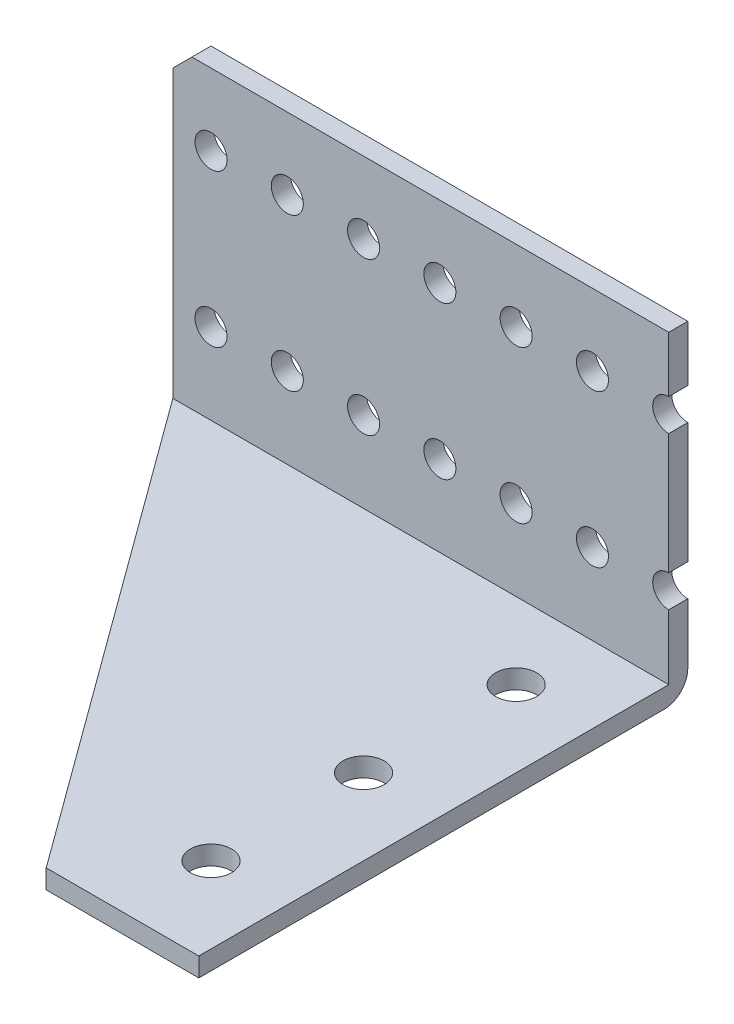
ISO-10303-21;
HEADER;
FILE_DESCRIPTION(('STEP AP214'),'2;1');
FILE_NAME('part.step','',(''),(''),'','','');
FILE_SCHEMA(('AUTOMOTIVE_DESIGN { 1 0 10303 214 1 1 1 1 }'));
ENDSEC;
DATA;
#1=APPLICATION_CONTEXT('core data for automotive mechanical design processes');
#2=APPLICATION_PROTOCOL_DEFINITION('international standard','automotive_design',2000,#1);
#3=PRODUCT_CONTEXT('',#1,'mechanical');
#4=PRODUCT('Part','Part','',(#3));
#5=PRODUCT_RELATED_PRODUCT_CATEGORY('part','',(#4));
#6=PRODUCT_DEFINITION_FORMATION('','',#4);
#7=PRODUCT_DEFINITION_CONTEXT('part definition',#1,'design');
#8=PRODUCT_DEFINITION('design','',#6,#7);
#9=PRODUCT_DEFINITION_SHAPE('','',#8);
#10=(LENGTH_UNIT() NAMED_UNIT(*) SI_UNIT(.MILLI.,.METRE.));
#11=(NAMED_UNIT(*) PLANE_ANGLE_UNIT() SI_UNIT($,.RADIAN.));
#12=(NAMED_UNIT(*) SI_UNIT($,.STERADIAN.) SOLID_ANGLE_UNIT());
#13=UNCERTAINTY_MEASURE_WITH_UNIT(LENGTH_MEASURE(1.E-05),#10,'distance_accuracy_value','');
#14=(GEOMETRIC_REPRESENTATION_CONTEXT(3) GLOBAL_UNCERTAINTY_ASSIGNED_CONTEXT((#13)) GLOBAL_UNIT_ASSIGNED_CONTEXT((#10,
#11,#12)) REPRESENTATION_CONTEXT('',''));
#15=CARTESIAN_POINT('',(0.,0.,0.));
#16=DIRECTION('',(0.,0.,1.));
#17=DIRECTION('',(1.,0.,0.));
#18=AXIS2_PLACEMENT_3D('',#15,#16,#17);
#19=CARTESIAN_POINT('',(41.275,-31.75,40.7035));
#20=DIRECTION('',(-1.,0.,0.));
#21=DIRECTION('',(0.,0.,1.));
#22=AXIS2_PLACEMENT_3D('',#19,#20,#21);
#23=PLANE('',#22);
#24=DIRECTION('',(0.,-1.,0.));
#25=VECTOR('',#24,1.);
#26=CARTESIAN_POINT('',(41.275,19.05,-37.5284999999999));
#27=LINE('',#26,#25);
#28=CARTESIAN_POINT('',(41.275,19.05,-37.5284999999999));
#29=VERTEX_POINT('',#28);
#30=CARTESIAN_POINT('',(41.275,9.779,-37.5284999999999));
#31=VERTEX_POINT('',#30);
#32=EDGE_CURVE('E158',#29,#31,#27,.T.);
#33=ORIENTED_EDGE('',*,*,#32,.T.);
#34=DIRECTION('',(0.,0.,-1.));
#35=VECTOR('',#34,1.);
#36=CARTESIAN_POINT('',(41.275,9.779,-40.7035));
#37=LINE('',#36,#35);
#38=CARTESIAN_POINT('',(41.275,9.779,-40.7035));
#39=VERTEX_POINT('',#38);
#40=EDGE_CURVE('E289',#31,#39,#37,.T.);
#41=ORIENTED_EDGE('',*,*,#40,.T.);
#42=DIRECTION('',(0.,-1.,0.));
#43=VECTOR('',#42,1.);
#44=CARTESIAN_POINT('',(41.275,-31.75,-40.7035));
#45=LINE('',#44,#43);
#46=CARTESIAN_POINT('',(41.275,19.05,-40.7035));
#47=VERTEX_POINT('',#46);
#48=EDGE_CURVE('E168',#47,#39,#45,.T.);
#49=ORIENTED_EDGE('',*,*,#48,.F.);
#50=DIRECTION('',(0.,0.,-1.));
#51=VECTOR('',#50,1.);
#52=CARTESIAN_POINT('',(41.275,19.05,-37.5284999999999));
#53=LINE('',#52,#51);
#54=EDGE_CURVE('E259',#29,#47,#53,.T.);
#55=ORIENTED_EDGE('',*,*,#54,.F.);
#56=EDGE_LOOP('',(#33,#41,#49,#55));
#57=FACE_BOUND('',#56,.T.);
#58=ADVANCED_FACE('F45',(#57),#23,.F.);
#59=CARTESIAN_POINT('',(41.275,-31.75,-40.7035));
#60=DIRECTION('',(0.,0.,1.));
#61=DIRECTION('',(1.,0.,0.));
#62=AXIS2_PLACEMENT_3D('',#59,#60,#61);
#63=PLANE('',#62);
#64=CARTESIAN_POINT('',(-22.225,7.11200000000002,-40.7035));
#65=DIRECTION('',(0.,0.,-1.));
#66=DIRECTION('',(-1.,0.,0.));
#67=AXIS2_PLACEMENT_3D('',#64,#65,#66);
#68=CIRCLE('',#67,2.66699999999999);
#69=CARTESIAN_POINT('',(-24.892,7.11200000000002,-40.7035));
#70=VERTEX_POINT('',#69);
#71=EDGE_CURVE('E338',#70,#70,#68,.T.);
#72=ORIENTED_EDGE('',*,*,#71,.F.);
#73=EDGE_LOOP('',(#72));
#74=FACE_BOUND('',#73,.T.);
#75=CARTESIAN_POINT('',(-9.52499999999998,7.11200000000002,-40.7035));
#76=DIRECTION('',(0.,0.,-1.));
#77=DIRECTION('',(-1.,0.,0.));
#78=AXIS2_PLACEMENT_3D('',#75,#76,#77);
#79=CIRCLE('',#78,2.66699999999998);
#80=CARTESIAN_POINT('',(-12.192,7.11200000000002,-40.7035));
#81=VERTEX_POINT('',#80);
#82=EDGE_CURVE('E210',#81,#81,#79,.T.);
#83=ORIENTED_EDGE('',*,*,#82,.F.);
#84=EDGE_LOOP('',(#83));
#85=FACE_BOUND('',#84,.T.);
#86=CARTESIAN_POINT('',(3.17500000000006,7.11200000000002,-40.7035));
#87=DIRECTION('',(0.,0.,-1.));
#88=DIRECTION('',(-1.,0.,0.));
#89=AXIS2_PLACEMENT_3D('',#86,#87,#88);
#90=CIRCLE('',#89,2.66699999999998);
#91=CARTESIAN_POINT('',(0.508000000000076,7.11200000000002,-40.7035));
#92=VERTEX_POINT('',#91);
#93=EDGE_CURVE('E209',#92,#92,#90,.T.);
#94=ORIENTED_EDGE('',*,*,#93,.F.);
#95=EDGE_LOOP('',(#94));
#96=FACE_BOUND('',#95,.T.);
#97=CARTESIAN_POINT('',(15.8750000000001,7.11200000000002,-40.7035));
#98=DIRECTION('',(0.,0.,-1.));
#99=DIRECTION('',(-1.,0.,0.));
#100=AXIS2_PLACEMENT_3D('',#97,#98,#99);
#101=CIRCLE('',#100,2.66699999999998);
#102=CARTESIAN_POINT('',(13.2080000000001,7.11200000000002,-40.7035));
#103=VERTEX_POINT('',#102);
#104=EDGE_CURVE('E205',#103,#103,#101,.T.);
#105=ORIENTED_EDGE('',*,*,#104,.F.);
#106=EDGE_LOOP('',(#105));
#107=FACE_BOUND('',#106,.T.);
#108=CARTESIAN_POINT('',(28.5750000000001,7.11200000000002,-40.7035));
#109=DIRECTION('',(0.,0.,-1.));
#110=DIRECTION('',(-1.,0.,0.));
#111=AXIS2_PLACEMENT_3D('',#108,#109,#110);
#112=CIRCLE('',#111,2.66699999999998);
#113=CARTESIAN_POINT('',(25.9080000000001,7.11200000000002,-40.7035));
#114=VERTEX_POINT('',#113);
#115=EDGE_CURVE('E201',#114,#114,#112,.T.);
#116=ORIENTED_EDGE('',*,*,#115,.F.);
#117=EDGE_LOOP('',(#116));
#118=FACE_BOUND('',#117,.T.);
#119=CARTESIAN_POINT('',(-22.225,-18.2879999999999,-40.7035));
#120=DIRECTION('',(0.,0.,-1.));
#121=DIRECTION('',(-1.,0.,0.));
#122=AXIS2_PLACEMENT_3D('',#119,#120,#121);
#123=CIRCLE('',#122,2.66699999999999);
#124=CARTESIAN_POINT('',(-24.892,-18.2879999999999,-40.7035));
#125=VERTEX_POINT('',#124);
#126=EDGE_CURVE('E200',#125,#125,#123,.T.);
#127=ORIENTED_EDGE('',*,*,#126,.F.);
#128=EDGE_LOOP('',(#127));
#129=FACE_BOUND('',#128,.T.);
#130=CARTESIAN_POINT('',(-9.52499999999998,-18.2879999999999,-40.7035));
#131=DIRECTION('',(0.,0.,-1.));
#132=DIRECTION('',(-1.,0.,0.));
#133=AXIS2_PLACEMENT_3D('',#130,#131,#132);
#134=CIRCLE('',#133,2.66699999999998);
#135=CARTESIAN_POINT('',(-12.192,-18.2879999999999,-40.7035));
#136=VERTEX_POINT('',#135);
#137=EDGE_CURVE('E196',#136,#136,#134,.T.);
#138=ORIENTED_EDGE('',*,*,#137,.F.);
#139=EDGE_LOOP('',(#138));
#140=FACE_BOUND('',#139,.T.);
#141=CARTESIAN_POINT('',(3.17500000000006,-18.2879999999999,-40.7035));
#142=DIRECTION('',(0.,0.,-1.));
#143=DIRECTION('',(-1.,0.,0.));
#144=AXIS2_PLACEMENT_3D('',#141,#142,#143);
#145=CIRCLE('',#144,2.66699999999998);
#146=CARTESIAN_POINT('',(0.508000000000076,-18.2879999999999,-40.7035));
#147=VERTEX_POINT('',#146);
#148=EDGE_CURVE('E192',#147,#147,#145,.T.);
#149=ORIENTED_EDGE('',*,*,#148,.F.);
#150=EDGE_LOOP('',(#149));
#151=FACE_BOUND('',#150,.T.);
#152=CARTESIAN_POINT('',(15.8750000000001,-18.2879999999999,-40.7035));
#153=DIRECTION('',(0.,0.,-1.));
#154=DIRECTION('',(-1.,0.,0.));
#155=AXIS2_PLACEMENT_3D('',#152,#153,#154);
#156=CIRCLE('',#155,2.66699999999998);
#157=CARTESIAN_POINT('',(13.2080000000001,-18.2879999999999,-40.7035));
#158=VERTEX_POINT('',#157);
#159=EDGE_CURVE('E188',#158,#158,#156,.T.);
#160=ORIENTED_EDGE('',*,*,#159,.F.);
#161=EDGE_LOOP('',(#160));
#162=FACE_BOUND('',#161,.T.);
#163=CARTESIAN_POINT('',(28.5750000000001,-18.2879999999999,-40.7035));
#164=DIRECTION('',(0.,0.,-1.));
#165=DIRECTION('',(-1.,0.,0.));
#166=AXIS2_PLACEMENT_3D('',#163,#164,#165);
#167=CIRCLE('',#166,2.66699999999998);
#168=CARTESIAN_POINT('',(25.9080000000001,-18.2879999999999,-40.7035));
#169=VERTEX_POINT('',#168);
#170=EDGE_CURVE('E187',#169,#169,#167,.T.);
#171=ORIENTED_EDGE('',*,*,#170,.F.);
#172=EDGE_LOOP('',(#171));
#173=FACE_BOUND('',#172,.T.);
#174=CARTESIAN_POINT('',(-34.925,7.11200000000002,-40.7035));
#175=DIRECTION('',(0.,0.,-1.));
#176=DIRECTION('',(-1.,0.,0.));
#177=AXIS2_PLACEMENT_3D('',#174,#175,#176);
#178=CIRCLE('',#177,2.66699999999998);
#179=CARTESIAN_POINT('',(-37.592,7.11200000000002,-40.7035));
#180=VERTEX_POINT('',#179);
#181=EDGE_CURVE('E305',#180,#180,#178,.T.);
#182=ORIENTED_EDGE('',*,*,#181,.F.);
#183=EDGE_LOOP('',(#182));
#184=FACE_BOUND('',#183,.T.);
#185=CARTESIAN_POINT('',(-34.925,-18.2879999999999,-40.7035));
#186=DIRECTION('',(0.,0.,-1.));
#187=DIRECTION('',(-1.,0.,0.));
#188=AXIS2_PLACEMENT_3D('',#185,#186,#187);
#189=CIRCLE('',#188,2.66699999999998);
#190=CARTESIAN_POINT('',(-37.592,-18.2879999999999,-40.7035));
#191=VERTEX_POINT('',#190);
#192=EDGE_CURVE('E299',#191,#191,#189,.T.);
#193=ORIENTED_EDGE('',*,*,#192,.F.);
#194=EDGE_LOOP('',(#193));
#195=FACE_BOUND('',#194,.T.);
#196=CARTESIAN_POINT('',(41.275,-20.9549999999999,-40.7035));
#197=VERTEX_POINT('',#196);
#198=CARTESIAN_POINT('',(41.275,-30.988,-40.7035));
#199=VERTEX_POINT('',#198);
#200=EDGE_CURVE('E167',#197,#199,#45,.T.);
#201=ORIENTED_EDGE('',*,*,#200,.T.);
#202=DIRECTION('',(-1.,0.,0.));
#203=VECTOR('',#202,1.);
#204=CARTESIAN_POINT('',(41.275,-30.988,-40.7035));
#205=LINE('',#204,#203);
#206=CARTESIAN_POINT('',(-41.275,-30.988,-40.7035));
#207=VERTEX_POINT('',#206);
#208=EDGE_CURVE('E219',#199,#207,#205,.T.);
#209=ORIENTED_EDGE('',*,*,#208,.T.);
#210=DIRECTION('',(0.,-1.,0.));
#211=VECTOR('',#210,1.);
#212=CARTESIAN_POINT('',(-41.275,-31.75,-40.7035));
#213=LINE('',#212,#211);
#214=CARTESIAN_POINT('',(-41.275,15.875,-40.7035));
#215=VERTEX_POINT('',#214);
#216=EDGE_CURVE('E164',#215,#207,#213,.T.);
#217=ORIENTED_EDGE('',*,*,#216,.F.);
#218=DIRECTION('',(-0.707106781186544,-0.707106781186551,0.));
#219=VECTOR('',#218,1.);
#220=CARTESIAN_POINT('',(-38.1,19.05,-40.7035));
#221=LINE('',#220,#219);
#222=CARTESIAN_POINT('',(-38.1,19.05,-40.7035));
#223=VERTEX_POINT('',#222);
#224=EDGE_CURVE('E217',#215,#223,#221,.F.);
#225=ORIENTED_EDGE('',*,*,#224,.T.);
#226=DIRECTION('',(-1.,0.,0.));
#227=VECTOR('',#226,1.);
#228=CARTESIAN_POINT('',(-41.275,19.05,-40.7035));
#229=LINE('',#228,#227);
#230=EDGE_CURVE('E254',#47,#223,#229,.T.);
#231=ORIENTED_EDGE('',*,*,#230,.F.);
#232=ORIENTED_EDGE('',*,*,#48,.T.);
#233=CARTESIAN_POINT('',(41.275,7.11200000000002,-40.7035));
#234=DIRECTION('',(0.,0.,-1.));
#235=DIRECTION('',(-1.,0.,0.));
#236=AXIS2_PLACEMENT_3D('',#233,#234,#235);
#237=CIRCLE('',#236,2.66699999999998);
#238=CARTESIAN_POINT('',(41.275,4.44500000000004,-40.7035));
#239=VERTEX_POINT('',#238);
#240=EDGE_CURVE('E294',#239,#39,#237,.T.);
#241=ORIENTED_EDGE('',*,*,#240,.F.);
#242=CARTESIAN_POINT('',(41.275,-15.621,-40.7035));
#243=VERTEX_POINT('',#242);
#244=EDGE_CURVE('E172',#239,#243,#45,.T.);
#245=ORIENTED_EDGE('',*,*,#244,.T.);
#246=CARTESIAN_POINT('',(41.275,-18.2879999999999,-40.7035));
#247=DIRECTION('',(0.,0.,-1.));
#248=DIRECTION('',(-1.,0.,0.));
#249=AXIS2_PLACEMENT_3D('',#246,#247,#248);
#250=CIRCLE('',#249,2.66699999999998);
#251=EDGE_CURVE('E237',#197,#243,#250,.T.);
#252=ORIENTED_EDGE('',*,*,#251,.F.);
#253=EDGE_LOOP('',(#201,#209,#217,#225,#231,#232,#241,#245,#252));
#254=FACE_BOUND('',#253,.T.);
#255=ADVANCED_FACE('F234',(#74,#85,#96,#107,#118,#129,#140,#151,#162,#173,#184,#195,#254),#63,.F.);
#256=ORIENTED_EDGE('',*,*,#244,.F.);
#257=DIRECTION('',(0.,0.,-1.));
#258=VECTOR('',#257,1.);
#259=CARTESIAN_POINT('',(41.275,4.44500000000004,-40.7035));
#260=LINE('',#259,#258);
#261=CARTESIAN_POINT('',(41.275,4.44500000000004,-37.5284999999999));
#262=VERTEX_POINT('',#261);
#263=EDGE_CURVE('E286',#239,#262,#260,.F.);
#264=ORIENTED_EDGE('',*,*,#263,.T.);
#265=CARTESIAN_POINT('',(41.275,-15.621,-37.5284999999999));
#266=VERTEX_POINT('',#265);
#267=EDGE_CURVE('E271',#262,#266,#27,.T.);
#268=ORIENTED_EDGE('',*,*,#267,.T.);
#269=DIRECTION('',(0.,0.,-1.));
#270=VECTOR('',#269,1.);
#271=CARTESIAN_POINT('',(41.275,-15.621,-40.7035));
#272=LINE('',#271,#270);
#273=EDGE_CURVE('E177',#266,#243,#272,.T.);
#274=ORIENTED_EDGE('',*,*,#273,.T.);
#275=EDGE_LOOP('',(#256,#264,#268,#274));
#276=FACE_BOUND('',#275,.T.);
#277=ADVANCED_FACE('F285',(#276),#23,.F.);
#278=CARTESIAN_POINT('',(-41.275,-31.75,40.7035));
#279=DIRECTION('',(0.,0.,-1.));
#280=DIRECTION('',(-1.,0.,0.));
#281=AXIS2_PLACEMENT_3D('',#278,#279,#280);
#282=PLANE('',#281);
#283=DIRECTION('',(1.,0.,0.));
#284=VECTOR('',#283,1.);
#285=CARTESIAN_POINT('',(-41.275,-31.75,40.7035));
#286=LINE('',#285,#284);
#287=CARTESIAN_POINT('',(15.875,-31.75,40.7035));
#288=VERTEX_POINT('',#287);
#289=CARTESIAN_POINT('',(41.275,-31.75,40.7035));
#290=VERTEX_POINT('',#289);
#291=EDGE_CURVE('E148',#288,#290,#286,.T.);
#292=ORIENTED_EDGE('',*,*,#291,.F.);
#293=DIRECTION('',(0.,-1.,0.));
#294=VECTOR('',#293,1.);
#295=CARTESIAN_POINT('',(15.875,19.05,40.7035));
#296=LINE('',#295,#294);
#297=CARTESIAN_POINT('',(15.875,-34.925,40.7035));
#298=VERTEX_POINT('',#297);
#299=EDGE_CURVE('E138',#288,#298,#296,.T.);
#300=ORIENTED_EDGE('',*,*,#299,.T.);
#301=DIRECTION('',(1.,0.,0.));
#302=VECTOR('',#301,1.);
#303=CARTESIAN_POINT('',(-41.275,-34.925,40.7035));
#304=LINE('',#303,#302);
#305=CARTESIAN_POINT('',(41.275,-34.925,40.7035));
#306=VERTEX_POINT('',#305);
#307=EDGE_CURVE('E147',#298,#306,#304,.T.);
#308=ORIENTED_EDGE('',*,*,#307,.T.);
#309=DIRECTION('',(0.,-1.,0.));
#310=VECTOR('',#309,1.);
#311=CARTESIAN_POINT('',(41.275,-31.75,40.7035));
#312=LINE('',#311,#310);
#313=EDGE_CURVE('E171',#290,#306,#312,.T.);
#314=ORIENTED_EDGE('',*,*,#313,.F.);
#315=EDGE_LOOP('',(#292,#300,#308,#314));
#316=FACE_BOUND('',#315,.T.);
#317=ADVANCED_FACE('F145',(#316),#282,.F.);
#318=DIRECTION('',(0.,0.,-1.));
#319=VECTOR('',#318,1.);
#320=CARTESIAN_POINT('',(41.275,-34.925,40.7035));
#321=LINE('',#320,#319);
#322=CARTESIAN_POINT('',(41.275,-34.925,-36.7665));
#323=VERTEX_POINT('',#322);
#324=EDGE_CURVE('E152',#306,#323,#321,.T.);
#325=ORIENTED_EDGE('',*,*,#324,.T.);
#326=CARTESIAN_POINT('',(41.275,-30.988,-36.7665));
#327=DIRECTION('',(-1.,0.,0.));
#328=DIRECTION('',(0.,0.,1.));
#329=AXIS2_PLACEMENT_3D('',#326,#327,#328);
#330=CIRCLE('',#329,3.937);
#331=EDGE_CURVE('E53',#323,#199,#330,.F.);
#332=ORIENTED_EDGE('',*,*,#331,.T.);
#333=ORIENTED_EDGE('',*,*,#200,.F.);
#334=DIRECTION('',(0.,0.,-1.));
#335=VECTOR('',#334,1.);
#336=CARTESIAN_POINT('',(41.275,-20.9549999999999,-40.7035));
#337=LINE('',#336,#335);
#338=CARTESIAN_POINT('',(41.275,-20.9549999999999,-37.5284999999999));
#339=VERTEX_POINT('',#338);
#340=EDGE_CURVE('E174',#197,#339,#337,.F.);
#341=ORIENTED_EDGE('',*,*,#340,.T.);
#342=CARTESIAN_POINT('',(41.275,-31.75,-37.5284999999999));
#343=VERTEX_POINT('',#342);
#344=EDGE_CURVE('E269',#339,#343,#27,.T.);
#345=ORIENTED_EDGE('',*,*,#344,.T.);
#346=DIRECTION('',(0.,0.,-1.));
#347=VECTOR('',#346,1.);
#348=CARTESIAN_POINT('',(41.275,-31.75,40.7035));
#349=LINE('',#348,#347);
#350=EDGE_CURVE('E161',#290,#343,#349,.T.);
#351=ORIENTED_EDGE('',*,*,#350,.F.);
#352=ORIENTED_EDGE('',*,*,#313,.T.);
#353=EDGE_LOOP('',(#325,#332,#333,#341,#345,#351,#352));
#354=FACE_BOUND('',#353,.T.);
#355=ADVANCED_FACE('F229',(#354),#23,.F.);
#356=CARTESIAN_POINT('',(-41.275,-31.75,40.7035));
#357=DIRECTION('',(1.,0.,0.));
#358=DIRECTION('',(0.,0.,-1.));
#359=AXIS2_PLACEMENT_3D('',#356,#357,#358);
#360=PLANE('',#359);
#361=CARTESIAN_POINT('',(-41.275,-30.988,-36.7665));
#362=DIRECTION('',(1.,0.,0.));
#363=DIRECTION('',(0.,0.,-1.));
#364=AXIS2_PLACEMENT_3D('',#361,#362,#363);
#365=CIRCLE('',#364,3.937);
#366=CARTESIAN_POINT('',(-41.275,-34.8505542067394,-37.5284999999999));
#367=VERTEX_POINT('',#366);
#368=EDGE_CURVE('E222',#207,#367,#365,.F.);
#369=ORIENTED_EDGE('',*,*,#368,.T.);
#370=DIRECTION('',(0.,-1.,0.));
#371=VECTOR('',#370,1.);
#372=CARTESIAN_POINT('',(-41.275,19.05,-37.5284999999999));
#373=LINE('',#372,#371);
#374=CARTESIAN_POINT('',(-41.275,-31.75,-37.5284999999999));
#375=VERTEX_POINT('',#374);
#376=EDGE_CURVE('E59',#375,#367,#373,.T.);
#377=ORIENTED_EDGE('',*,*,#376,.F.);
#378=DIRECTION('',(0.,-1.,0.));
#379=VECTOR('',#378,1.);
#380=CARTESIAN_POINT('',(-41.275,19.05,-37.5284999999999));
#381=LINE('',#380,#379);
#382=CARTESIAN_POINT('',(-41.275,15.875,-37.5284999999999));
#383=VERTEX_POINT('',#382);
#384=EDGE_CURVE('E154',#383,#375,#381,.T.);
#385=ORIENTED_EDGE('',*,*,#384,.F.);
#386=DIRECTION('',(0.,0.,-1.));
#387=VECTOR('',#386,1.);
#388=CARTESIAN_POINT('',(-41.275,15.875,40.7035));
#389=LINE('',#388,#387);
#390=EDGE_CURVE('E215',#383,#215,#389,.T.);
#391=ORIENTED_EDGE('',*,*,#390,.T.);
#392=ORIENTED_EDGE('',*,*,#216,.T.);
#393=EDGE_LOOP('',(#369,#377,#385,#391,#392));
#394=FACE_BOUND('',#393,.T.);
#395=ADVANCED_FACE('F239',(#394),#360,.F.);
#396=CARTESIAN_POINT('',(0.,-31.75,0.));
#397=DIRECTION('',(0.,1.,0.));
#398=DIRECTION('',(0.,0.,1.));
#399=AXIS2_PLACEMENT_3D('',#396,#397,#398);
#400=PLANE('',#399);
#401=DIRECTION('',(-0.589885116714,0.,-0.807487181990718));
#402=VECTOR('',#401,1.);
#403=CARTESIAN_POINT('',(-9.03701688787469,-31.75,6.601716882376));
#404=LINE('',#403,#402);
#405=EDGE_CURVE('E149',#288,#375,#404,.T.);
#406=ORIENTED_EDGE('',*,*,#405,.F.);
#407=ORIENTED_EDGE('',*,*,#291,.T.);
#408=ORIENTED_EDGE('',*,*,#350,.T.);
#409=DIRECTION('',(1.,0.,0.));
#410=VECTOR('',#409,1.);
#411=CARTESIAN_POINT('',(41.275,-31.75,-37.5284999999999));
#412=LINE('',#411,#410);
#413=EDGE_CURVE('E260',#375,#343,#412,.T.);
#414=ORIENTED_EDGE('',*,*,#413,.F.);
#415=EDGE_LOOP('',(#406,#407,#408,#414));
#416=FACE_BOUND('',#415,.T.);
#417=CARTESIAN_POINT('',(28.575,-31.75,-24.8284999999999));
#418=DIRECTION('',(0.,1.,0.));
#419=DIRECTION('',(0.,0.,1.));
#420=AXIS2_PLACEMENT_3D('',#417,#418,#419);
#421=CIRCLE('',#420,3.42899999999998);
#422=CARTESIAN_POINT('',(28.575,-31.75,-21.3994999999999));
#423=VERTEX_POINT('',#422);
#424=EDGE_CURVE('E341',#423,#423,#421,.T.);
#425=ORIENTED_EDGE('',*,*,#424,.F.);
#426=EDGE_LOOP('',(#425));
#427=FACE_BOUND('',#426,.T.);
#428=CARTESIAN_POINT('',(28.5749999999997,-31.75,0.571500000000131));
#429=DIRECTION('',(0.,1.,0.));
#430=DIRECTION('',(0.,0.,1.));
#431=AXIS2_PLACEMENT_3D('',#428,#429,#430);
#432=CIRCLE('',#431,3.42899999999998);
#433=CARTESIAN_POINT('',(28.5749999999997,-31.75,4.00050000000011));
#434=VERTEX_POINT('',#433);
#435=EDGE_CURVE('E344',#434,#434,#432,.T.);
#436=ORIENTED_EDGE('',*,*,#435,.F.);
#437=EDGE_LOOP('',(#436));
#438=FACE_BOUND('',#437,.T.);
#439=CARTESIAN_POINT('',(28.5749999999995,-31.75,25.9715000000001));
#440=DIRECTION('',(0.,1.,0.));
#441=DIRECTION('',(0.,0.,1.));
#442=AXIS2_PLACEMENT_3D('',#439,#440,#441);
#443=CIRCLE('',#442,3.42899999999998);
#444=CARTESIAN_POINT('',(28.5749999999995,-31.75,29.4005000000001));
#445=VERTEX_POINT('',#444);
#446=EDGE_CURVE('E347',#445,#445,#443,.T.);
#447=ORIENTED_EDGE('',*,*,#446,.F.);
#448=EDGE_LOOP('',(#447));
#449=FACE_BOUND('',#448,.T.);
#450=ADVANCED_FACE('F276',(#416,#427,#438,#449),#400,.T.);
#451=CARTESIAN_POINT('',(0.,-34.925,0.));
#452=DIRECTION('',(0.,1.,0.));
#453=DIRECTION('',(0.,0.,1.));
#454=AXIS2_PLACEMENT_3D('',#451,#452,#453);
#455=PLANE('',#454);
#456=CARTESIAN_POINT('',(28.575,-34.925,-24.8284999999999));
#457=DIRECTION('',(0.,-1.,0.));
#458=DIRECTION('',(0.,0.,-1.));
#459=AXIS2_PLACEMENT_3D('',#456,#457,#458);
#460=CIRCLE('',#459,3.42899999999998);
#461=CARTESIAN_POINT('',(28.575,-34.925,-28.2574999999998));
#462=VERTEX_POINT('',#461);
#463=EDGE_CURVE('E141',#462,#462,#460,.T.);
#464=ORIENTED_EDGE('',*,*,#463,.F.);
#465=EDGE_LOOP('',(#464));
#466=FACE_BOUND('',#465,.T.);
#467=CARTESIAN_POINT('',(28.5749999999997,-34.925,0.571500000000131));
#468=DIRECTION('',(0.,-1.,0.));
#469=DIRECTION('',(0.,0.,-1.));
#470=AXIS2_PLACEMENT_3D('',#467,#468,#469);
#471=CIRCLE('',#470,3.42899999999998);
#472=CARTESIAN_POINT('',(28.5749999999997,-34.925,-2.85749999999985));
#473=VERTEX_POINT('',#472);
#474=EDGE_CURVE('E354',#473,#473,#471,.T.);
#475=ORIENTED_EDGE('',*,*,#474,.F.);
#476=EDGE_LOOP('',(#475));
#477=FACE_BOUND('',#476,.T.);
#478=CARTESIAN_POINT('',(28.5749999999995,-34.925,25.9715000000001));
#479=DIRECTION('',(0.,-1.,0.));
#480=DIRECTION('',(0.,0.,-1.));
#481=AXIS2_PLACEMENT_3D('',#478,#479,#480);
#482=CIRCLE('',#481,3.42899999999998);
#483=CARTESIAN_POINT('',(28.5749999999995,-34.925,22.5425000000001));
#484=VERTEX_POINT('',#483);
#485=EDGE_CURVE('E351',#484,#484,#482,.T.);
#486=ORIENTED_EDGE('',*,*,#485,.F.);
#487=EDGE_LOOP('',(#486));
#488=FACE_BOUND('',#487,.T.);
#489=ORIENTED_EDGE('',*,*,#307,.F.);
#490=DIRECTION('',(0.589885116714,0.,0.807487181990718));
#491=VECTOR('',#490,1.);
#492=CARTESIAN_POINT('',(-41.275,-34.925,-37.5284999999999));
#493=LINE('',#492,#491);
#494=CARTESIAN_POINT('',(-40.7183441558442,-34.925,-36.7665));
#495=VERTEX_POINT('',#494);
#496=EDGE_CURVE('E135',#495,#298,#493,.T.);
#497=ORIENTED_EDGE('',*,*,#496,.F.);
#498=DIRECTION('',(-1.,0.,0.));
#499=VECTOR('',#498,1.);
#500=CARTESIAN_POINT('',(0.,-34.925,-36.7665));
#501=LINE('',#500,#499);
#502=EDGE_CURVE('E67',#495,#323,#501,.F.);
#503=ORIENTED_EDGE('',*,*,#502,.T.);
#504=ORIENTED_EDGE('',*,*,#324,.F.);
#505=EDGE_LOOP('',(#489,#497,#503,#504));
#506=FACE_BOUND('',#505,.T.);
#507=ADVANCED_FACE('F151',(#466,#477,#488,#506),#455,.F.);
#508=CARTESIAN_POINT('',(41.275,19.05,-37.5284999999999));
#509=DIRECTION('',(0.,0.,-1.));
#510=DIRECTION('',(-1.,0.,0.));
#511=AXIS2_PLACEMENT_3D('',#508,#509,#510);
#512=PLANE('',#511);
#513=CARTESIAN_POINT('',(-22.225,7.11200000000002,-37.5284999999999));
#514=DIRECTION('',(0.,0.,-1.));
#515=DIRECTION('',(-1.,0.,0.));
#516=AXIS2_PLACEMENT_3D('',#513,#514,#515);
#517=CIRCLE('',#516,2.66699999999998);
#518=CARTESIAN_POINT('',(-24.892,7.11200000000002,-37.5284999999999));
#519=VERTEX_POINT('',#518);
#520=EDGE_CURVE('E335',#519,#519,#517,.T.);
#521=ORIENTED_EDGE('',*,*,#520,.T.);
#522=EDGE_LOOP('',(#521));
#523=FACE_BOUND('',#522,.T.);
#524=CARTESIAN_POINT('',(-9.52499999999998,7.11200000000002,-37.5284999999999));
#525=DIRECTION('',(0.,0.,-1.));
#526=DIRECTION('',(-1.,0.,0.));
#527=AXIS2_PLACEMENT_3D('',#524,#525,#526);
#528=CIRCLE('',#527,2.66699999999998);
#529=CARTESIAN_POINT('',(-12.192,7.11200000000002,-37.5284999999999));
#530=VERTEX_POINT('',#529);
#531=EDGE_CURVE('E206',#530,#530,#528,.T.);
#532=ORIENTED_EDGE('',*,*,#531,.T.);
#533=EDGE_LOOP('',(#532));
#534=FACE_BOUND('',#533,.T.);
#535=CARTESIAN_POINT('',(3.17500000000006,7.11200000000002,-37.5284999999999));
#536=DIRECTION('',(0.,0.,-1.));
#537=DIRECTION('',(-1.,0.,0.));
#538=AXIS2_PLACEMENT_3D('',#535,#536,#537);
#539=CIRCLE('',#538,2.66699999999998);
#540=CARTESIAN_POINT('',(0.50800000000008,7.11200000000002,-37.5284999999999));
#541=VERTEX_POINT('',#540);
#542=EDGE_CURVE('E328',#541,#541,#539,.T.);
#543=ORIENTED_EDGE('',*,*,#542,.T.);
#544=EDGE_LOOP('',(#543));
#545=FACE_BOUND('',#544,.T.);
#546=CARTESIAN_POINT('',(15.8750000000001,7.11200000000002,-37.5284999999999));
#547=DIRECTION('',(0.,0.,-1.));
#548=DIRECTION('',(-1.,0.,0.));
#549=AXIS2_PLACEMENT_3D('',#546,#547,#548);
#550=CIRCLE('',#549,2.66699999999998);
#551=CARTESIAN_POINT('',(13.2080000000001,7.11200000000002,-37.5284999999999));
#552=VERTEX_POINT('',#551);
#553=EDGE_CURVE('E202',#552,#552,#550,.T.);
#554=ORIENTED_EDGE('',*,*,#553,.T.);
#555=EDGE_LOOP('',(#554));
#556=FACE_BOUND('',#555,.T.);
#557=CARTESIAN_POINT('',(28.5750000000001,7.11200000000002,-37.5284999999999));
#558=DIRECTION('',(0.,0.,-1.));
#559=DIRECTION('',(-1.,0.,0.));
#560=AXIS2_PLACEMENT_3D('',#557,#558,#559);
#561=CIRCLE('',#560,2.66699999999998);
#562=CARTESIAN_POINT('',(25.9080000000001,7.11200000000002,-37.5284999999999));
#563=VERTEX_POINT('',#562);
#564=EDGE_CURVE('E197',#563,#563,#561,.T.);
#565=ORIENTED_EDGE('',*,*,#564,.T.);
#566=EDGE_LOOP('',(#565));
#567=FACE_BOUND('',#566,.T.);
#568=CARTESIAN_POINT('',(-22.225,-18.2879999999999,-37.5284999999999));
#569=DIRECTION('',(0.,0.,-1.));
#570=DIRECTION('',(-1.,0.,0.));
#571=AXIS2_PLACEMENT_3D('',#568,#569,#570);
#572=CIRCLE('',#571,2.66699999999998);
#573=CARTESIAN_POINT('',(-24.892,-18.2879999999999,-37.5284999999999));
#574=VERTEX_POINT('',#573);
#575=EDGE_CURVE('E319',#574,#574,#572,.T.);
#576=ORIENTED_EDGE('',*,*,#575,.T.);
#577=EDGE_LOOP('',(#576));
#578=FACE_BOUND('',#577,.T.);
#579=CARTESIAN_POINT('',(-9.52499999999998,-18.2879999999999,-37.5284999999999));
#580=DIRECTION('',(0.,0.,-1.));
#581=DIRECTION('',(-1.,0.,0.));
#582=AXIS2_PLACEMENT_3D('',#579,#580,#581);
#583=CIRCLE('',#582,2.66699999999998);
#584=CARTESIAN_POINT('',(-12.192,-18.2879999999999,-37.5284999999999));
#585=VERTEX_POINT('',#584);
#586=EDGE_CURVE('E193',#585,#585,#583,.T.);
#587=ORIENTED_EDGE('',*,*,#586,.T.);
#588=EDGE_LOOP('',(#587));
#589=FACE_BOUND('',#588,.T.);
#590=CARTESIAN_POINT('',(3.17500000000006,-18.2879999999999,-37.5284999999999));
#591=DIRECTION('',(0.,0.,-1.));
#592=DIRECTION('',(-1.,0.,0.));
#593=AXIS2_PLACEMENT_3D('',#590,#591,#592);
#594=CIRCLE('',#593,2.66699999999998);
#595=CARTESIAN_POINT('',(0.50800000000008,-18.2879999999999,-37.5284999999999));
#596=VERTEX_POINT('',#595);
#597=EDGE_CURVE('E189',#596,#596,#594,.T.);
#598=ORIENTED_EDGE('',*,*,#597,.T.);
#599=EDGE_LOOP('',(#598));
#600=FACE_BOUND('',#599,.T.);
#601=CARTESIAN_POINT('',(15.8750000000001,-18.2879999999999,-37.5284999999999));
#602=DIRECTION('',(0.,0.,-1.));
#603=DIRECTION('',(-1.,0.,0.));
#604=AXIS2_PLACEMENT_3D('',#601,#602,#603);
#605=CIRCLE('',#604,2.66699999999998);
#606=CARTESIAN_POINT('',(13.2080000000001,-18.2879999999999,-37.5284999999999));
#607=VERTEX_POINT('',#606);
#608=EDGE_CURVE('E184',#607,#607,#605,.T.);
#609=ORIENTED_EDGE('',*,*,#608,.T.);
#610=EDGE_LOOP('',(#609));
#611=FACE_BOUND('',#610,.T.);
#612=CARTESIAN_POINT('',(28.5750000000001,-18.2879999999999,-37.5284999999999));
#613=DIRECTION('',(0.,0.,-1.));
#614=DIRECTION('',(-1.,0.,0.));
#615=AXIS2_PLACEMENT_3D('',#612,#613,#614);
#616=CIRCLE('',#615,2.66699999999998);
#617=CARTESIAN_POINT('',(25.9080000000001,-18.2879999999999,-37.5284999999999));
#618=VERTEX_POINT('',#617);
#619=EDGE_CURVE('E308',#618,#618,#616,.T.);
#620=ORIENTED_EDGE('',*,*,#619,.T.);
#621=EDGE_LOOP('',(#620));
#622=FACE_BOUND('',#621,.T.);
#623=CARTESIAN_POINT('',(-34.925,7.11200000000002,-37.5284999999999));
#624=DIRECTION('',(0.,0.,-1.));
#625=DIRECTION('',(-1.,0.,0.));
#626=AXIS2_PLACEMENT_3D('',#623,#624,#625);
#627=CIRCLE('',#626,2.66699999999998);
#628=CARTESIAN_POINT('',(-37.592,7.11200000000002,-37.5284999999999));
#629=VERTEX_POINT('',#628);
#630=EDGE_CURVE('E302',#629,#629,#627,.T.);
#631=ORIENTED_EDGE('',*,*,#630,.T.);
#632=EDGE_LOOP('',(#631));
#633=FACE_BOUND('',#632,.T.);
#634=CARTESIAN_POINT('',(-34.925,-18.2879999999999,-37.5284999999999));
#635=DIRECTION('',(0.,0.,-1.));
#636=DIRECTION('',(-1.,0.,0.));
#637=AXIS2_PLACEMENT_3D('',#634,#635,#636);
#638=CIRCLE('',#637,2.66699999999998);
#639=CARTESIAN_POINT('',(-37.592,-18.2879999999999,-37.5284999999999));
#640=VERTEX_POINT('',#639);
#641=EDGE_CURVE('E296',#640,#640,#638,.T.);
#642=ORIENTED_EDGE('',*,*,#641,.T.);
#643=EDGE_LOOP('',(#642));
#644=FACE_BOUND('',#643,.T.);
#645=DIRECTION('',(1.,0.,0.));
#646=VECTOR('',#645,1.);
#647=CARTESIAN_POINT('',(41.275,19.05,-37.5284999999999));
#648=LINE('',#647,#646);
#649=CARTESIAN_POINT('',(-38.1,19.05,-37.5284999999999));
#650=VERTEX_POINT('',#649);
#651=EDGE_CURVE('E252',#650,#29,#648,.T.);
#652=ORIENTED_EDGE('',*,*,#651,.F.);
#653=DIRECTION('',(0.707106781186544,0.707106781186551,0.));
#654=VECTOR('',#653,1.);
#655=CARTESIAN_POINT('',(-38.1,19.05,-37.5284999999999));
#656=LINE('',#655,#654);
#657=EDGE_CURVE('E213',#650,#383,#656,.F.);
#658=ORIENTED_EDGE('',*,*,#657,.T.);
#659=ORIENTED_EDGE('',*,*,#384,.T.);
#660=ORIENTED_EDGE('',*,*,#413,.T.);
#661=ORIENTED_EDGE('',*,*,#344,.F.);
#662=CARTESIAN_POINT('',(41.275,-18.2879999999999,-37.5284999999999));
#663=DIRECTION('',(0.,0.,-1.));
#664=DIRECTION('',(-1.,0.,0.));
#665=AXIS2_PLACEMENT_3D('',#662,#663,#664);
#666=CIRCLE('',#665,2.66699999999998);
#667=EDGE_CURVE('E264',#339,#266,#666,.T.);
#668=ORIENTED_EDGE('',*,*,#667,.T.);
#669=ORIENTED_EDGE('',*,*,#267,.F.);
#670=CARTESIAN_POINT('',(41.275,7.11200000000002,-37.5284999999999));
#671=DIRECTION('',(0.,0.,-1.));
#672=DIRECTION('',(-1.,0.,0.));
#673=AXIS2_PLACEMENT_3D('',#670,#671,#672);
#674=CIRCLE('',#673,2.66699999999998);
#675=EDGE_CURVE('E180',#262,#31,#674,.T.);
#676=ORIENTED_EDGE('',*,*,#675,.T.);
#677=ORIENTED_EDGE('',*,*,#32,.F.);
#678=EDGE_LOOP('',(#652,#658,#659,#660,#661,#668,#669,#676,#677));
#679=FACE_BOUND('',#678,.T.);
#680=ADVANCED_FACE('F256',(#523,#534,#545,#556,#567,#578,#589,#600,#611,#622,#633,#644,#679),
#512,.F.);
#681=CARTESIAN_POINT('',(0.,19.05,0.));
#682=DIRECTION('',(0.,-1.,0.));
#683=DIRECTION('',(0.,0.,-1.));
#684=AXIS2_PLACEMENT_3D('',#681,#682,#683);
#685=PLANE('',#684);
#686=ORIENTED_EDGE('',*,*,#230,.T.);
#687=DIRECTION('',(0.,0.,1.));
#688=VECTOR('',#687,1.);
#689=CARTESIAN_POINT('',(-38.1,19.05,0.));
#690=LINE('',#689,#688);
#691=EDGE_CURVE('E183',#223,#650,#690,.T.);
#692=ORIENTED_EDGE('',*,*,#691,.T.);
#693=ORIENTED_EDGE('',*,*,#651,.T.);
#694=ORIENTED_EDGE('',*,*,#54,.T.);
#695=EDGE_LOOP('',(#686,#692,#693,#694));
#696=FACE_BOUND('',#695,.T.);
#697=ADVANCED_FACE('F250',(#696),#685,.F.);
#698=CARTESIAN_POINT('',(41.275,-18.2879999999999,-40.7035));
#699=DIRECTION('',(0.,0.,-1.));
#700=DIRECTION('',(-1.,0.,0.));
#701=AXIS2_PLACEMENT_3D('',#698,#699,#700);
#702=CYLINDRICAL_SURFACE('',#701,2.66699999999998);
#703=ORIENTED_EDGE('',*,*,#667,.F.);
#704=ORIENTED_EDGE('',*,*,#340,.F.);
#705=ORIENTED_EDGE('',*,*,#251,.T.);
#706=ORIENTED_EDGE('',*,*,#273,.F.);
#707=EDGE_LOOP('',(#703,#704,#705,#706));
#708=FACE_BOUND('',#707,.T.);
#709=ADVANCED_FACE('F288',(#708),#702,.F.);
#710=CARTESIAN_POINT('',(41.275,7.11200000000002,-40.7035));
#711=DIRECTION('',(0.,0.,-1.));
#712=DIRECTION('',(-1.,0.,0.));
#713=AXIS2_PLACEMENT_3D('',#710,#711,#712);
#714=CYLINDRICAL_SURFACE('',#713,2.66699999999998);
#715=ORIENTED_EDGE('',*,*,#675,.F.);
#716=ORIENTED_EDGE('',*,*,#263,.F.);
#717=ORIENTED_EDGE('',*,*,#240,.T.);
#718=ORIENTED_EDGE('',*,*,#40,.F.);
#719=EDGE_LOOP('',(#715,#716,#717,#718));
#720=FACE_BOUND('',#719,.T.);
#721=ADVANCED_FACE('F458',(#720),#714,.F.);
#722=CARTESIAN_POINT('',(-34.925,-18.2879999999999,-40.7035));
#723=DIRECTION('',(0.,0.,-1.));
#724=DIRECTION('',(-1.,0.,0.));
#725=AXIS2_PLACEMENT_3D('',#722,#723,#724);
#726=CYLINDRICAL_SURFACE('',#725,2.66699999999998);
#727=ORIENTED_EDGE('',*,*,#192,.T.);
#728=EDGE_LOOP('',(#727));
#729=FACE_BOUND('',#728,.T.);
#730=ORIENTED_EDGE('',*,*,#641,.F.);
#731=EDGE_LOOP('',(#730));
#732=FACE_BOUND('',#731,.T.);
#733=ADVANCED_FACE('F454',(#729,#732),#726,.F.);
#734=CARTESIAN_POINT('',(-34.925,7.11200000000002,-40.7035));
#735=DIRECTION('',(0.,0.,-1.));
#736=DIRECTION('',(-1.,0.,0.));
#737=AXIS2_PLACEMENT_3D('',#734,#735,#736);
#738=CYLINDRICAL_SURFACE('',#737,2.66699999999998);
#739=ORIENTED_EDGE('',*,*,#181,.T.);
#740=EDGE_LOOP('',(#739));
#741=FACE_BOUND('',#740,.T.);
#742=ORIENTED_EDGE('',*,*,#630,.F.);
#743=EDGE_LOOP('',(#742));
#744=FACE_BOUND('',#743,.T.);
#745=ADVANCED_FACE('F450',(#741,#744),#738,.F.);
#746=CARTESIAN_POINT('',(28.5750000000001,-18.2879999999999,-40.7035));
#747=DIRECTION('',(0.,0.,-1.));
#748=DIRECTION('',(-1.,0.,0.));
#749=AXIS2_PLACEMENT_3D('',#746,#747,#748);
#750=CYLINDRICAL_SURFACE('',#749,2.66699999999998);
#751=ORIENTED_EDGE('',*,*,#170,.T.);
#752=EDGE_LOOP('',(#751));
#753=FACE_BOUND('',#752,.T.);
#754=ORIENTED_EDGE('',*,*,#619,.F.);
#755=EDGE_LOOP('',(#754));
#756=FACE_BOUND('',#755,.T.);
#757=ADVANCED_FACE('F446',(#753,#756),#750,.F.);
#758=CARTESIAN_POINT('',(15.8750000000001,-18.2879999999999,-40.7035));
#759=DIRECTION('',(0.,0.,-1.));
#760=DIRECTION('',(-1.,0.,0.));
#761=AXIS2_PLACEMENT_3D('',#758,#759,#760);
#762=CYLINDRICAL_SURFACE('',#761,2.66699999999998);
#763=ORIENTED_EDGE('',*,*,#159,.T.);
#764=EDGE_LOOP('',(#763));
#765=FACE_BOUND('',#764,.T.);
#766=ORIENTED_EDGE('',*,*,#608,.F.);
#767=EDGE_LOOP('',(#766));
#768=FACE_BOUND('',#767,.T.);
#769=ADVANCED_FACE('F442',(#765,#768),#762,.F.);
#770=CARTESIAN_POINT('',(3.17500000000006,-18.2879999999999,-40.7035));
#771=DIRECTION('',(0.,0.,-1.));
#772=DIRECTION('',(-1.,0.,0.));
#773=AXIS2_PLACEMENT_3D('',#770,#771,#772);
#774=CYLINDRICAL_SURFACE('',#773,2.66699999999998);
#775=ORIENTED_EDGE('',*,*,#148,.T.);
#776=EDGE_LOOP('',(#775));
#777=FACE_BOUND('',#776,.T.);
#778=ORIENTED_EDGE('',*,*,#597,.F.);
#779=EDGE_LOOP('',(#778));
#780=FACE_BOUND('',#779,.T.);
#781=ADVANCED_FACE('F438',(#777,#780),#774,.F.);
#782=CARTESIAN_POINT('',(-9.52499999999998,-18.2879999999999,-40.7035));
#783=DIRECTION('',(0.,0.,-1.));
#784=DIRECTION('',(-1.,0.,0.));
#785=AXIS2_PLACEMENT_3D('',#782,#783,#784);
#786=CYLINDRICAL_SURFACE('',#785,2.66699999999998);
#787=ORIENTED_EDGE('',*,*,#137,.T.);
#788=EDGE_LOOP('',(#787));
#789=FACE_BOUND('',#788,.T.);
#790=ORIENTED_EDGE('',*,*,#586,.F.);
#791=EDGE_LOOP('',(#790));
#792=FACE_BOUND('',#791,.T.);
#793=ADVANCED_FACE('F434',(#789,#792),#786,.F.);
#794=CARTESIAN_POINT('',(-22.225,-18.2879999999999,-40.7035));
#795=DIRECTION('',(0.,0.,-1.));
#796=DIRECTION('',(-1.,0.,0.));
#797=AXIS2_PLACEMENT_3D('',#794,#795,#796);
#798=CYLINDRICAL_SURFACE('',#797,2.66699999999998);
#799=ORIENTED_EDGE('',*,*,#126,.T.);
#800=EDGE_LOOP('',(#799));
#801=FACE_BOUND('',#800,.T.);
#802=ORIENTED_EDGE('',*,*,#575,.F.);
#803=EDGE_LOOP('',(#802));
#804=FACE_BOUND('',#803,.T.);
#805=ADVANCED_FACE('F430',(#801,#804),#798,.F.);
#806=CARTESIAN_POINT('',(28.5750000000001,7.11200000000002,-40.7035));
#807=DIRECTION('',(0.,0.,-1.));
#808=DIRECTION('',(-1.,0.,0.));
#809=AXIS2_PLACEMENT_3D('',#806,#807,#808);
#810=CYLINDRICAL_SURFACE('',#809,2.66699999999998);
#811=ORIENTED_EDGE('',*,*,#115,.T.);
#812=EDGE_LOOP('',(#811));
#813=FACE_BOUND('',#812,.T.);
#814=ORIENTED_EDGE('',*,*,#564,.F.);
#815=EDGE_LOOP('',(#814));
#816=FACE_BOUND('',#815,.T.);
#817=ADVANCED_FACE('F426',(#813,#816),#810,.F.);
#818=CARTESIAN_POINT('',(15.8750000000001,7.11200000000002,-40.7035));
#819=DIRECTION('',(0.,0.,-1.));
#820=DIRECTION('',(-1.,0.,0.));
#821=AXIS2_PLACEMENT_3D('',#818,#819,#820);
#822=CYLINDRICAL_SURFACE('',#821,2.66699999999998);
#823=ORIENTED_EDGE('',*,*,#104,.T.);
#824=EDGE_LOOP('',(#823));
#825=FACE_BOUND('',#824,.T.);
#826=ORIENTED_EDGE('',*,*,#553,.F.);
#827=EDGE_LOOP('',(#826));
#828=FACE_BOUND('',#827,.T.);
#829=ADVANCED_FACE('F422',(#825,#828),#822,.F.);
#830=CARTESIAN_POINT('',(3.17500000000006,7.11200000000002,-40.7035));
#831=DIRECTION('',(0.,0.,-1.));
#832=DIRECTION('',(-1.,0.,0.));
#833=AXIS2_PLACEMENT_3D('',#830,#831,#832);
#834=CYLINDRICAL_SURFACE('',#833,2.66699999999998);
#835=ORIENTED_EDGE('',*,*,#93,.T.);
#836=EDGE_LOOP('',(#835));
#837=FACE_BOUND('',#836,.T.);
#838=ORIENTED_EDGE('',*,*,#542,.F.);
#839=EDGE_LOOP('',(#838));
#840=FACE_BOUND('',#839,.T.);
#841=ADVANCED_FACE('F415',(#837,#840),#834,.F.);
#842=CARTESIAN_POINT('',(-9.52499999999998,7.11200000000002,-40.7035));
#843=DIRECTION('',(0.,0.,-1.));
#844=DIRECTION('',(-1.,0.,0.));
#845=AXIS2_PLACEMENT_3D('',#842,#843,#844);
#846=CYLINDRICAL_SURFACE('',#845,2.66699999999998);
#847=ORIENTED_EDGE('',*,*,#82,.T.);
#848=EDGE_LOOP('',(#847));
#849=FACE_BOUND('',#848,.T.);
#850=ORIENTED_EDGE('',*,*,#531,.F.);
#851=EDGE_LOOP('',(#850));
#852=FACE_BOUND('',#851,.T.);
#853=ADVANCED_FACE('F410',(#849,#852),#846,.F.);
#854=CARTESIAN_POINT('',(-22.225,7.11200000000002,-40.7035));
#855=DIRECTION('',(0.,0.,-1.));
#856=DIRECTION('',(-1.,0.,0.));
#857=AXIS2_PLACEMENT_3D('',#854,#855,#856);
#858=CYLINDRICAL_SURFACE('',#857,2.66699999999998);
#859=ORIENTED_EDGE('',*,*,#71,.T.);
#860=EDGE_LOOP('',(#859));
#861=FACE_BOUND('',#860,.T.);
#862=ORIENTED_EDGE('',*,*,#520,.F.);
#863=EDGE_LOOP('',(#862));
#864=FACE_BOUND('',#863,.T.);
#865=ADVANCED_FACE('F405',(#861,#864),#858,.F.);
#866=CARTESIAN_POINT('',(-38.1,19.05,0.));
#867=DIRECTION('',(0.707106781186551,-0.707106781186544,0.));
#868=DIRECTION('',(0.,0.,1.));
#869=AXIS2_PLACEMENT_3D('',#866,#867,#868);
#870=PLANE('',#869);
#871=ORIENTED_EDGE('',*,*,#224,.F.);
#872=ORIENTED_EDGE('',*,*,#390,.F.);
#873=ORIENTED_EDGE('',*,*,#657,.F.);
#874=ORIENTED_EDGE('',*,*,#691,.F.);
#875=EDGE_LOOP('',(#871,#872,#873,#874));
#876=FACE_BOUND('',#875,.T.);
#877=ADVANCED_FACE('F247',(#876),#870,.F.);
#878=CARTESIAN_POINT('',(41.275,-30.988,-36.7665));
#879=DIRECTION('',(-1.,0.,0.));
#880=DIRECTION('',(0.,0.,1.));
#881=AXIS2_PLACEMENT_3D('',#878,#879,#880);
#882=CYLINDRICAL_SURFACE('',#881,3.937);
#883=CARTESIAN_POINT('',(-40.7183441558442,-30.988,-36.7665));
#884=DIRECTION('',(0.807487181990718,0.,-0.589885116714));
#885=DIRECTION('',(-0.589885116714,0.,-0.807487181990718));
#886=AXIS2_PLACEMENT_3D('',#883,#884,#885);
#887=ELLIPSE('',#886,4.87561918976103,3.937);
#888=EDGE_CURVE('E12',#367,#495,#887,.F.);
#889=ORIENTED_EDGE('',*,*,#888,.F.);
#890=ORIENTED_EDGE('',*,*,#368,.F.);
#891=ORIENTED_EDGE('',*,*,#208,.F.);
#892=ORIENTED_EDGE('',*,*,#331,.F.);
#893=ORIENTED_EDGE('',*,*,#502,.F.);
#894=EDGE_LOOP('',(#889,#890,#891,#892,#893));
#895=FACE_BOUND('',#894,.T.);
#896=ADVANCED_FACE('F47',(#895),#882,.T.);
#897=CARTESIAN_POINT('',(-41.275,19.05,-37.5284999999999));
#898=DIRECTION('',(0.807487181990718,0.,-0.589885116714));
#899=DIRECTION('',(-0.589885116714,0.,-0.807487181990718));
#900=AXIS2_PLACEMENT_3D('',#897,#898,#899);
#901=PLANE('',#900);
#902=ORIENTED_EDGE('',*,*,#405,.T.);
#903=ORIENTED_EDGE('',*,*,#376,.T.);
#904=ORIENTED_EDGE('',*,*,#888,.T.);
#905=ORIENTED_EDGE('',*,*,#496,.T.);
#906=ORIENTED_EDGE('',*,*,#299,.F.);
#907=EDGE_LOOP('',(#902,#903,#904,#905,#906));
#908=FACE_BOUND('',#907,.T.);
#909=ADVANCED_FACE('F137',(#908),#901,.F.);
#910=CARTESIAN_POINT('',(28.5749999999995,19.05,25.9715000000001));
#911=DIRECTION('',(0.,-1.,0.));
#912=DIRECTION('',(0.,0.,-1.));
#913=AXIS2_PLACEMENT_3D('',#910,#911,#912);
#914=CYLINDRICAL_SURFACE('',#913,3.42899999999998);
#915=ORIENTED_EDGE('',*,*,#446,.T.);
#916=EDGE_LOOP('',(#915));
#917=FACE_BOUND('',#916,.T.);
#918=ORIENTED_EDGE('',*,*,#485,.T.);
#919=EDGE_LOOP('',(#918));
#920=FACE_BOUND('',#919,.T.);
#921=ADVANCED_FACE('F370',(#917,#920),#914,.F.);
#922=CARTESIAN_POINT('',(28.5749999999997,19.05,0.571500000000131));
#923=DIRECTION('',(0.,-1.,0.));
#924=DIRECTION('',(0.,0.,-1.));
#925=AXIS2_PLACEMENT_3D('',#922,#923,#924);
#926=CYLINDRICAL_SURFACE('',#925,3.42899999999998);
#927=ORIENTED_EDGE('',*,*,#435,.T.);
#928=EDGE_LOOP('',(#927));
#929=FACE_BOUND('',#928,.T.);
#930=ORIENTED_EDGE('',*,*,#474,.T.);
#931=EDGE_LOOP('',(#930));
#932=FACE_BOUND('',#931,.T.);
#933=ADVANCED_FACE('F372',(#929,#932),#926,.F.);
#934=CARTESIAN_POINT('',(28.575,19.05,-24.8284999999999));
#935=DIRECTION('',(0.,-1.,0.));
#936=DIRECTION('',(0.,0.,-1.));
#937=AXIS2_PLACEMENT_3D('',#934,#935,#936);
#938=CYLINDRICAL_SURFACE('',#937,3.42899999999998);
#939=ORIENTED_EDGE('',*,*,#424,.T.);
#940=EDGE_LOOP('',(#939));
#941=FACE_BOUND('',#940,.T.);
#942=ORIENTED_EDGE('',*,*,#463,.T.);
#943=EDGE_LOOP('',(#942));
#944=FACE_BOUND('',#943,.T.);
#945=ADVANCED_FACE('F361',(#941,#944),#938,.F.);
#946=CLOSED_SHELL('',(#58,#255,#277,#317,#355,#395,#450,#507,#680,#697,#709,#721,#733,#745,#757,
#769,#781,#793,#805,#817,#829,#841,#853,#865,#877,#896,#909,#921,#933,#945));
#947=MANIFOLD_SOLID_BREP('B2',#946);
#948=ADVANCED_BREP_SHAPE_REPRESENTATION('',(#18,#947),#14);
#949=SHAPE_DEFINITION_REPRESENTATION(#9,#948);
ENDSEC;
END-ISO-10303-21;
